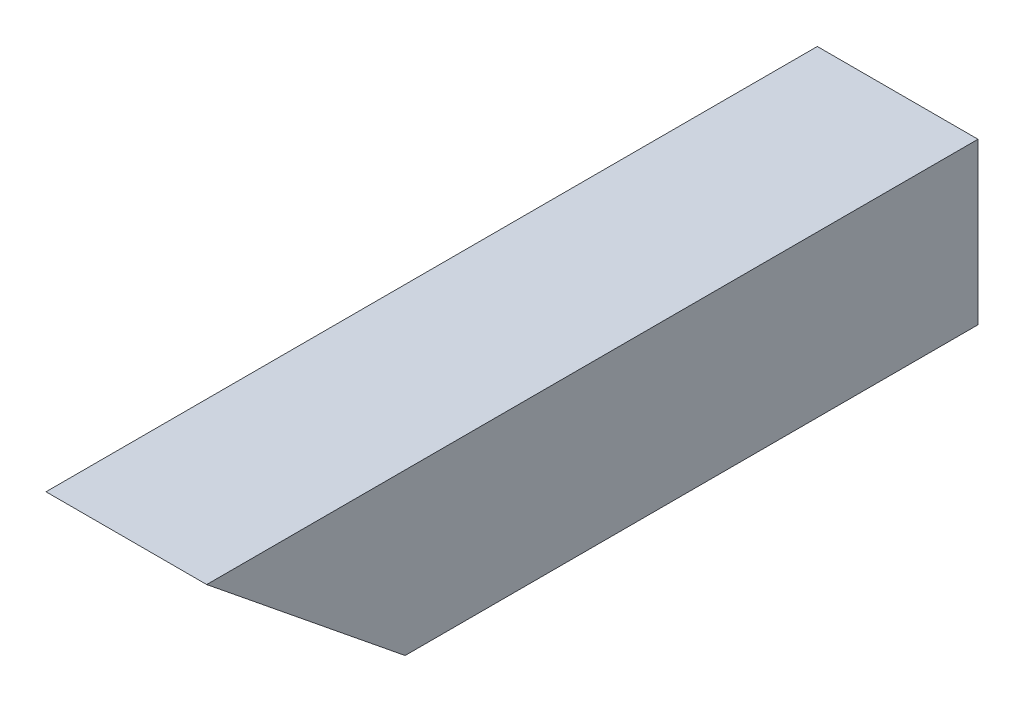
ISO-10303-21;
HEADER;
FILE_DESCRIPTION(('STEP AP214'),'2;1');
FILE_NAME('part.step','',(''),(''),'','','');
FILE_SCHEMA(('AUTOMOTIVE_DESIGN { 1 0 10303 214 1 1 1 1 }'));
ENDSEC;
DATA;
#1=APPLICATION_CONTEXT('core data for automotive mechanical design processes');
#2=APPLICATION_PROTOCOL_DEFINITION('international standard','automotive_design',2000,#1);
#3=PRODUCT_CONTEXT('',#1,'mechanical');
#4=PRODUCT('Part','Part','',(#3));
#5=PRODUCT_RELATED_PRODUCT_CATEGORY('part','',(#4));
#6=PRODUCT_DEFINITION_FORMATION('','',#4);
#7=PRODUCT_DEFINITION_CONTEXT('part definition',#1,'design');
#8=PRODUCT_DEFINITION('design','',#6,#7);
#9=PRODUCT_DEFINITION_SHAPE('','',#8);
#10=(LENGTH_UNIT() NAMED_UNIT(*) SI_UNIT(.MILLI.,.METRE.));
#11=(NAMED_UNIT(*) PLANE_ANGLE_UNIT() SI_UNIT($,.RADIAN.));
#12=(NAMED_UNIT(*) SI_UNIT($,.STERADIAN.) SOLID_ANGLE_UNIT());
#13=UNCERTAINTY_MEASURE_WITH_UNIT(LENGTH_MEASURE(1.E-05),#10,'distance_accuracy_value','');
#14=(GEOMETRIC_REPRESENTATION_CONTEXT(3) GLOBAL_UNCERTAINTY_ASSIGNED_CONTEXT((#13)) GLOBAL_UNIT_ASSIGNED_CONTEXT((#10,
#11,#12)) REPRESENTATION_CONTEXT('',''));
#15=CARTESIAN_POINT('',(0.,0.,0.));
#16=DIRECTION('',(0.,0.,1.));
#17=DIRECTION('',(1.,0.,0.));
#18=AXIS2_PLACEMENT_3D('',#15,#16,#17);
#19=CARTESIAN_POINT('',(0.,0.,0.));
#20=DIRECTION('',(0.,0.,1.));
#21=DIRECTION('',(1.,0.,0.));
#22=AXIS2_PLACEMENT_3D('',#19,#20,#21);
#23=PLANE('',#22);
#24=DIRECTION('',(0.,-1.,0.));
#25=VECTOR('',#24,1.);
#26=CARTESIAN_POINT('',(-15.875,-15.875,0.));
#27=LINE('',#26,#25);
#28=CARTESIAN_POINT('',(-15.875,15.875,0.));
#29=VERTEX_POINT('',#28);
#30=CARTESIAN_POINT('',(-15.875,-15.875,0.));
#31=VERTEX_POINT('',#30);
#32=EDGE_CURVE('E133',#29,#31,#27,.T.);
#33=ORIENTED_EDGE('',*,*,#32,.F.);
#34=DIRECTION('',(-1.,0.,0.));
#35=VECTOR('',#34,1.);
#36=CARTESIAN_POINT('',(15.875,15.875,0.));
#37=LINE('',#36,#35);
#38=CARTESIAN_POINT('',(15.875,15.875,0.));
#39=VERTEX_POINT('',#38);
#40=EDGE_CURVE('E128',#39,#29,#37,.T.);
#41=ORIENTED_EDGE('',*,*,#40,.F.);
#42=DIRECTION('',(0.,1.,0.));
#43=VECTOR('',#42,1.);
#44=CARTESIAN_POINT('',(15.875,-15.875,0.));
#45=LINE('',#44,#43);
#46=CARTESIAN_POINT('',(15.875,-15.875,0.));
#47=VERTEX_POINT('',#46);
#48=EDGE_CURVE('E130',#47,#39,#45,.T.);
#49=ORIENTED_EDGE('',*,*,#48,.F.);
#50=DIRECTION('',(1.,0.,0.));
#51=VECTOR('',#50,1.);
#52=CARTESIAN_POINT('',(15.875,-15.875,0.));
#53=LINE('',#52,#51);
#54=EDGE_CURVE('E119',#31,#47,#53,.T.);
#55=ORIENTED_EDGE('',*,*,#54,.F.);
#56=EDGE_LOOP('',(#33,#41,#49,#55));
#57=FACE_BOUND('',#56,.T.);
#58=DIRECTION('',(0.,1.,0.));
#59=VECTOR('',#58,1.);
#60=CARTESIAN_POINT('',(12.827,12.827,0.));
#61=LINE('',#60,#59);
#62=CARTESIAN_POINT('',(12.827,-12.827,0.));
#63=VERTEX_POINT('',#62);
#64=CARTESIAN_POINT('',(12.827,12.827,0.));
#65=VERTEX_POINT('',#64);
#66=EDGE_CURVE('E153',#63,#65,#61,.T.);
#67=ORIENTED_EDGE('',*,*,#66,.T.);
#68=DIRECTION('',(-1.,0.,0.));
#69=VECTOR('',#68,1.);
#70=CARTESIAN_POINT('',(-12.827,12.827,0.));
#71=LINE('',#70,#69);
#72=CARTESIAN_POINT('',(-12.827,12.827,0.));
#73=VERTEX_POINT('',#72);
#74=EDGE_CURVE('E150',#65,#73,#71,.T.);
#75=ORIENTED_EDGE('',*,*,#74,.T.);
#76=DIRECTION('',(0.,-1.,0.));
#77=VECTOR('',#76,1.);
#78=CARTESIAN_POINT('',(-12.827,12.827,0.));
#79=LINE('',#78,#77);
#80=CARTESIAN_POINT('',(-12.827,-12.827,0.));
#81=VERTEX_POINT('',#80);
#82=EDGE_CURVE('E147',#73,#81,#79,.T.);
#83=ORIENTED_EDGE('',*,*,#82,.T.);
#84=DIRECTION('',(1.,0.,0.));
#85=VECTOR('',#84,1.);
#86=CARTESIAN_POINT('',(-12.827,-12.827,0.));
#87=LINE('',#86,#85);
#88=EDGE_CURVE('E144',#81,#63,#87,.T.);
#89=ORIENTED_EDGE('',*,*,#88,.T.);
#90=EDGE_LOOP('',(#67,#75,#83,#89));
#91=FACE_BOUND('',#90,.T.);
#92=ADVANCED_FACE('F33',(#57,#91),#23,.F.);
#93=CARTESIAN_POINT('',(-15.875,-15.875,152.4));
#94=DIRECTION('',(1.,0.,0.));
#95=DIRECTION('',(0.,0.,-1.));
#96=AXIS2_PLACEMENT_3D('',#93,#94,#95);
#97=PLANE('',#96);
#98=DIRECTION('',(0.,0.,-1.));
#99=VECTOR('',#98,1.);
#100=CARTESIAN_POINT('',(-15.875,-15.875,152.4));
#101=LINE('',#100,#99);
#102=CARTESIAN_POINT('',(-15.875,-15.875,113.192015280012));
#103=VERTEX_POINT('',#102);
#104=EDGE_CURVE('E41',#103,#31,#101,.T.);
#105=ORIENTED_EDGE('',*,*,#104,.F.);
#106=DIRECTION('',(0.,0.629320391049833,0.777145961456974));
#107=VECTOR('',#106,1.);
#108=CARTESIAN_POINT('',(-15.875,15.875,152.4));
#109=LINE('',#108,#107);
#110=CARTESIAN_POINT('',(-15.875,15.875,152.4));
#111=VERTEX_POINT('',#110);
#112=EDGE_CURVE('E103',#103,#111,#109,.T.);
#113=ORIENTED_EDGE('',*,*,#112,.T.);
#114=DIRECTION('',(0.,0.,-1.));
#115=VECTOR('',#114,1.);
#116=CARTESIAN_POINT('',(-15.875,15.875,152.4));
#117=LINE('',#116,#115);
#118=EDGE_CURVE('E122',#111,#29,#117,.T.);
#119=ORIENTED_EDGE('',*,*,#118,.T.);
#120=ORIENTED_EDGE('',*,*,#32,.T.);
#121=EDGE_LOOP('',(#105,#113,#119,#120));
#122=FACE_BOUND('',#121,.T.);
#123=ADVANCED_FACE('F35',(#122),#97,.F.);
#124=CARTESIAN_POINT('',(15.875,-15.875,152.4));
#125=DIRECTION('',(0.,1.,0.));
#126=DIRECTION('',(-1.,0.,0.));
#127=AXIS2_PLACEMENT_3D('',#124,#125,#126);
#128=PLANE('',#127);
#129=DIRECTION('',(0.,0.,-1.));
#130=VECTOR('',#129,1.);
#131=CARTESIAN_POINT('',(15.875,-15.875,152.4));
#132=LINE('',#131,#130);
#133=CARTESIAN_POINT('',(15.875,-15.875,113.192015280012));
#134=VERTEX_POINT('',#133);
#135=EDGE_CURVE('E111',#134,#47,#132,.T.);
#136=ORIENTED_EDGE('',*,*,#135,.F.);
#137=DIRECTION('',(1.,0.,0.));
#138=VECTOR('',#137,1.);
#139=CARTESIAN_POINT('',(-15.875,-15.875,113.192015280012));
#140=LINE('',#139,#138);
#141=EDGE_CURVE('E97',#103,#134,#140,.T.);
#142=ORIENTED_EDGE('',*,*,#141,.F.);
#143=ORIENTED_EDGE('',*,*,#104,.T.);
#144=ORIENTED_EDGE('',*,*,#54,.T.);
#145=EDGE_LOOP('',(#136,#142,#143,#144));
#146=FACE_BOUND('',#145,.T.);
#147=ADVANCED_FACE('F117',(#146),#128,.F.);
#148=CARTESIAN_POINT('',(15.875,-15.875,152.4));
#149=DIRECTION('',(-1.,0.,0.));
#150=DIRECTION('',(0.,0.,1.));
#151=AXIS2_PLACEMENT_3D('',#148,#149,#150);
#152=PLANE('',#151);
#153=DIRECTION('',(0.,0.,-1.));
#154=VECTOR('',#153,1.);
#155=CARTESIAN_POINT('',(15.875,15.875,152.4));
#156=LINE('',#155,#154);
#157=CARTESIAN_POINT('',(15.875,15.875,152.4));
#158=VERTEX_POINT('',#157);
#159=EDGE_CURVE('E114',#158,#39,#156,.T.);
#160=ORIENTED_EDGE('',*,*,#159,.F.);
#161=DIRECTION('',(0.,0.629320391049833,0.777145961456974));
#162=VECTOR('',#161,1.);
#163=CARTESIAN_POINT('',(15.875,15.875,152.4));
#164=LINE('',#163,#162);
#165=EDGE_CURVE('E100',#134,#158,#164,.T.);
#166=ORIENTED_EDGE('',*,*,#165,.F.);
#167=ORIENTED_EDGE('',*,*,#135,.T.);
#168=ORIENTED_EDGE('',*,*,#48,.T.);
#169=EDGE_LOOP('',(#160,#166,#167,#168));
#170=FACE_BOUND('',#169,.T.);
#171=ADVANCED_FACE('F110',(#170),#152,.F.);
#172=CARTESIAN_POINT('',(15.875,15.875,152.4));
#173=DIRECTION('',(0.,-1.,0.));
#174=DIRECTION('',(1.,0.,0.));
#175=AXIS2_PLACEMENT_3D('',#172,#173,#174);
#176=PLANE('',#175);
#177=ORIENTED_EDGE('',*,*,#40,.T.);
#178=ORIENTED_EDGE('',*,*,#118,.F.);
#179=DIRECTION('',(-1.,0.,0.));
#180=VECTOR('',#179,1.);
#181=CARTESIAN_POINT('',(15.875,15.875,152.4));
#182=LINE('',#181,#180);
#183=EDGE_CURVE('E127',#158,#111,#182,.T.);
#184=ORIENTED_EDGE('',*,*,#183,.F.);
#185=ORIENTED_EDGE('',*,*,#159,.T.);
#186=EDGE_LOOP('',(#177,#178,#184,#185));
#187=FACE_BOUND('',#186,.T.);
#188=ADVANCED_FACE('F164',(#187),#176,.F.);
#189=CARTESIAN_POINT('',(12.827,12.827,152.4));
#190=DIRECTION('',(-1.,0.,0.));
#191=DIRECTION('',(0.,-1.,0.));
#192=AXIS2_PLACEMENT_3D('',#189,#190,#191);
#193=PLANE('',#192);
#194=DIRECTION('',(0.,-0.629320391049833,-0.777145961456974));
#195=VECTOR('',#194,1.);
#196=CARTESIAN_POINT('',(12.827,14.6678574168063,150.909303056482));
#197=LINE('',#196,#195);
#198=CARTESIAN_POINT('',(12.827,12.827,148.636033466881));
#199=VERTEX_POINT('',#198);
#200=CARTESIAN_POINT('',(12.827,-12.827,116.955981813131));
#201=VERTEX_POINT('',#200);
#202=EDGE_CURVE('E47',#199,#201,#197,.T.);
#203=ORIENTED_EDGE('',*,*,#202,.F.);
#204=DIRECTION('',(0.,0.,-1.));
#205=VECTOR('',#204,1.);
#206=CARTESIAN_POINT('',(12.827,12.827,152.4));
#207=LINE('',#206,#205);
#208=EDGE_CURVE('E136',#199,#65,#207,.T.);
#209=ORIENTED_EDGE('',*,*,#208,.T.);
#210=ORIENTED_EDGE('',*,*,#66,.F.);
#211=DIRECTION('',(0.,0.,-1.));
#212=VECTOR('',#211,1.);
#213=CARTESIAN_POINT('',(12.827,-12.827,152.4));
#214=LINE('',#213,#212);
#215=EDGE_CURVE('E54',#201,#63,#214,.T.);
#216=ORIENTED_EDGE('',*,*,#215,.F.);
#217=EDGE_LOOP('',(#203,#209,#210,#216));
#218=FACE_BOUND('',#217,.T.);
#219=ADVANCED_FACE('F172',(#218),#193,.T.);
#220=CARTESIAN_POINT('',(-12.827,12.827,152.4));
#221=DIRECTION('',(0.,-1.,0.));
#222=DIRECTION('',(0.,0.,-1.));
#223=AXIS2_PLACEMENT_3D('',#220,#221,#222);
#224=PLANE('',#223);
#225=DIRECTION('',(1.,0.,0.));
#226=VECTOR('',#225,1.);
#227=CARTESIAN_POINT('',(-12.827,12.827,148.636033466881));
#228=LINE('',#227,#226);
#229=CARTESIAN_POINT('',(-12.827,12.827,148.636033466881));
#230=VERTEX_POINT('',#229);
#231=EDGE_CURVE('E157',#230,#199,#228,.T.);
#232=ORIENTED_EDGE('',*,*,#231,.F.);
#233=DIRECTION('',(0.,0.,-1.));
#234=VECTOR('',#233,1.);
#235=CARTESIAN_POINT('',(-12.827,12.827,152.4));
#236=LINE('',#235,#234);
#237=EDGE_CURVE('E139',#230,#73,#236,.T.);
#238=ORIENTED_EDGE('',*,*,#237,.T.);
#239=ORIENTED_EDGE('',*,*,#74,.F.);
#240=ORIENTED_EDGE('',*,*,#208,.F.);
#241=EDGE_LOOP('',(#232,#238,#239,#240));
#242=FACE_BOUND('',#241,.T.);
#243=ADVANCED_FACE('F176',(#242),#224,.T.);
#244=CARTESIAN_POINT('',(-12.827,12.827,152.4));
#245=DIRECTION('',(1.,0.,0.));
#246=DIRECTION('',(0.,1.,0.));
#247=AXIS2_PLACEMENT_3D('',#244,#245,#246);
#248=PLANE('',#247);
#249=DIRECTION('',(0.,0.629320391049833,0.777145961456974));
#250=VECTOR('',#249,1.);
#251=CARTESIAN_POINT('',(-12.827,14.6678574168063,150.909303056482));
#252=LINE('',#251,#250);
#253=CARTESIAN_POINT('',(-12.827,-12.827,116.955981813131));
#254=VERTEX_POINT('',#253);
#255=EDGE_CURVE('E107',#254,#230,#252,.T.);
#256=ORIENTED_EDGE('',*,*,#255,.F.);
#257=DIRECTION('',(0.,0.,-1.));
#258=VECTOR('',#257,1.);
#259=CARTESIAN_POINT('',(-12.827,-12.827,152.4));
#260=LINE('',#259,#258);
#261=EDGE_CURVE('E141',#254,#81,#260,.T.);
#262=ORIENTED_EDGE('',*,*,#261,.T.);
#263=ORIENTED_EDGE('',*,*,#82,.F.);
#264=ORIENTED_EDGE('',*,*,#237,.F.);
#265=EDGE_LOOP('',(#256,#262,#263,#264));
#266=FACE_BOUND('',#265,.T.);
#267=ADVANCED_FACE('F181',(#266),#248,.T.);
#268=CARTESIAN_POINT('',(-12.827,-12.827,152.4));
#269=DIRECTION('',(0.,1.,0.));
#270=DIRECTION('',(-1.,0.,0.));
#271=AXIS2_PLACEMENT_3D('',#268,#269,#270);
#272=PLANE('',#271);
#273=DIRECTION('',(-1.,0.,0.));
#274=VECTOR('',#273,1.);
#275=CARTESIAN_POINT('',(-12.827,-12.827,116.955981813131));
#276=LINE('',#275,#274);
#277=EDGE_CURVE('E11',#201,#254,#276,.T.);
#278=ORIENTED_EDGE('',*,*,#277,.F.);
#279=ORIENTED_EDGE('',*,*,#215,.T.);
#280=ORIENTED_EDGE('',*,*,#88,.F.);
#281=ORIENTED_EDGE('',*,*,#261,.F.);
#282=EDGE_LOOP('',(#278,#279,#280,#281));
#283=FACE_BOUND('',#282,.T.);
#284=ADVANCED_FACE('F183',(#283),#272,.T.);
#285=CARTESIAN_POINT('',(-15.875,15.875,152.4));
#286=DIRECTION('',(0.,0.777145961456974,-0.629320391049833));
#287=DIRECTION('',(0.,0.629320391049833,0.777145961456974));
#288=AXIS2_PLACEMENT_3D('',#285,#286,#287);
#289=PLANE('',#288);
#290=ORIENTED_EDGE('',*,*,#202,.T.);
#291=ORIENTED_EDGE('',*,*,#277,.T.);
#292=ORIENTED_EDGE('',*,*,#255,.T.);
#293=ORIENTED_EDGE('',*,*,#231,.T.);
#294=EDGE_LOOP('',(#290,#291,#292,#293));
#295=FACE_BOUND('',#294,.T.);
#296=ORIENTED_EDGE('',*,*,#183,.T.);
#297=ORIENTED_EDGE('',*,*,#112,.F.);
#298=ORIENTED_EDGE('',*,*,#141,.T.);
#299=ORIENTED_EDGE('',*,*,#165,.T.);
#300=EDGE_LOOP('',(#296,#297,#298,#299));
#301=FACE_BOUND('',#300,.T.);
#302=ADVANCED_FACE('F99',(#295,#301),#289,.F.);
#303=CLOSED_SHELL('',(#92,#123,#147,#171,#188,#219,#243,#267,#284,#302));
#304=MANIFOLD_SOLID_BREP('B2',#303);
#305=ADVANCED_BREP_SHAPE_REPRESENTATION('',(#18,#304),#14);
#306=SHAPE_DEFINITION_REPRESENTATION(#9,#305);
ENDSEC;
END-ISO-10303-21;
